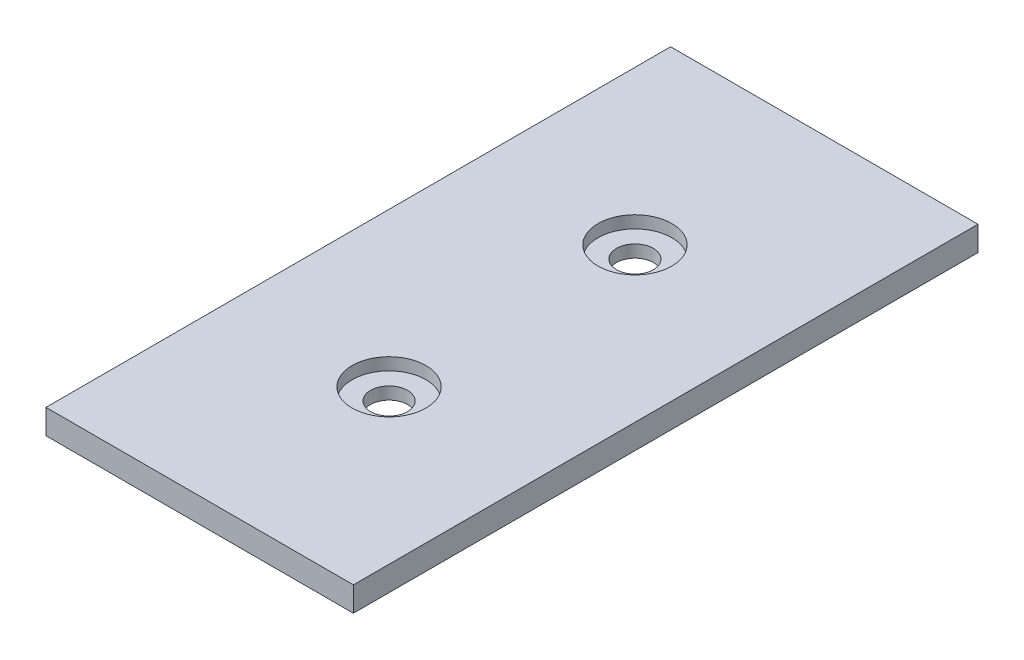
ISO-10303-21;
HEADER;
FILE_DESCRIPTION(('STEP AP214'),'2;1');
FILE_NAME('part.step','',(''),(''),'','','');
FILE_SCHEMA(('AUTOMOTIVE_DESIGN { 1 0 10303 214 1 1 1 1 }'));
ENDSEC;
DATA;
#1=APPLICATION_CONTEXT('core data for automotive mechanical design processes');
#2=APPLICATION_PROTOCOL_DEFINITION('international standard','automotive_design',2000,#1);
#3=PRODUCT_CONTEXT('',#1,'mechanical');
#4=PRODUCT('Part','Part','',(#3));
#5=PRODUCT_RELATED_PRODUCT_CATEGORY('part','',(#4));
#6=PRODUCT_DEFINITION_FORMATION('','',#4);
#7=PRODUCT_DEFINITION_CONTEXT('part definition',#1,'design');
#8=PRODUCT_DEFINITION('design','',#6,#7);
#9=PRODUCT_DEFINITION_SHAPE('','',#8);
#10=(LENGTH_UNIT() NAMED_UNIT(*) SI_UNIT(.MILLI.,.METRE.));
#11=(NAMED_UNIT(*) PLANE_ANGLE_UNIT() SI_UNIT($,.RADIAN.));
#12=(NAMED_UNIT(*) SI_UNIT($,.STERADIAN.) SOLID_ANGLE_UNIT());
#13=UNCERTAINTY_MEASURE_WITH_UNIT(LENGTH_MEASURE(1.E-05),#10,'distance_accuracy_value','');
#14=(GEOMETRIC_REPRESENTATION_CONTEXT(3) GLOBAL_UNCERTAINTY_ASSIGNED_CONTEXT((#13)) GLOBAL_UNIT_ASSIGNED_CONTEXT((#10,
#11,#12)) REPRESENTATION_CONTEXT('',''));
#15=CARTESIAN_POINT('',(0.,0.,0.));
#16=DIRECTION('',(0.,0.,1.));
#17=DIRECTION('',(1.,0.,0.));
#18=AXIS2_PLACEMENT_3D('',#15,#16,#17);
#19=CARTESIAN_POINT('',(0.,-6.,20.));
#20=DIRECTION('',(0.,1.,0.));
#21=DIRECTION('',(0.,0.,1.));
#22=AXIS2_PLACEMENT_3D('',#19,#20,#21);
#23=CYLINDRICAL_SURFACE('',#22,3.);
#24=CARTESIAN_POINT('',(0.,0.,20.));
#25=DIRECTION('',(0.,-1.,0.));
#26=DIRECTION('',(0.,0.,-1.));
#27=AXIS2_PLACEMENT_3D('',#24,#25,#26);
#28=CIRCLE('',#27,3.);
#29=CARTESIAN_POINT('',(0.,0.,17.));
#30=VERTEX_POINT('',#29);
#31=EDGE_CURVE('E130',#30,#30,#28,.T.);
#32=ORIENTED_EDGE('',*,*,#31,.T.);
#33=EDGE_LOOP('',(#32));
#34=FACE_BOUND('',#33,.T.);
#35=CARTESIAN_POINT('',(0.,2.,20.));
#36=DIRECTION('',(0.,1.,0.));
#37=DIRECTION('',(0.,0.,1.));
#38=AXIS2_PLACEMENT_3D('',#35,#36,#37);
#39=CIRCLE('',#38,3.);
#40=CARTESIAN_POINT('',(0.,2.,23.));
#41=VERTEX_POINT('',#40);
#42=EDGE_CURVE('E47',#41,#41,#39,.F.);
#43=ORIENTED_EDGE('',*,*,#42,.F.);
#44=EDGE_LOOP('',(#43));
#45=FACE_BOUND('',#44,.T.);
#46=ADVANCED_FACE('F43',(#34,#45),#23,.F.);
#47=CARTESIAN_POINT('',(0.,-6.,-20.));
#48=DIRECTION('',(0.,1.,0.));
#49=DIRECTION('',(0.,0.,1.));
#50=AXIS2_PLACEMENT_3D('',#47,#48,#49);
#51=CYLINDRICAL_SURFACE('',#50,3.);
#52=CARTESIAN_POINT('',(0.,0.,-20.));
#53=DIRECTION('',(0.,-1.,0.));
#54=DIRECTION('',(0.,0.,-1.));
#55=AXIS2_PLACEMENT_3D('',#52,#53,#54);
#56=CIRCLE('',#55,3.);
#57=CARTESIAN_POINT('',(0.,0.,-23.));
#58=VERTEX_POINT('',#57);
#59=EDGE_CURVE('E119',#58,#58,#56,.T.);
#60=ORIENTED_EDGE('',*,*,#59,.T.);
#61=EDGE_LOOP('',(#60));
#62=FACE_BOUND('',#61,.T.);
#63=CARTESIAN_POINT('',(0.,2.,-20.));
#64=DIRECTION('',(0.,1.,0.));
#65=DIRECTION('',(0.,0.,1.));
#66=AXIS2_PLACEMENT_3D('',#63,#64,#65);
#67=CIRCLE('',#66,3.);
#68=CARTESIAN_POINT('',(0.,2.,-17.));
#69=VERTEX_POINT('',#68);
#70=EDGE_CURVE('E136',#69,#69,#67,.F.);
#71=ORIENTED_EDGE('',*,*,#70,.F.);
#72=EDGE_LOOP('',(#71));
#73=FACE_BOUND('',#72,.T.);
#74=ADVANCED_FACE('F189',(#62,#73),#51,.F.);
#75=CARTESIAN_POINT('',(25.,4.,50.8));
#76=DIRECTION('',(-1.,0.,0.));
#77=DIRECTION('',(0.,0.,1.));
#78=AXIS2_PLACEMENT_3D('',#75,#76,#77);
#79=PLANE('',#78);
#80=DIRECTION('',(0.,0.,-1.));
#81=VECTOR('',#80,1.);
#82=CARTESIAN_POINT('',(25.,0.,50.8));
#83=LINE('',#82,#81);
#84=CARTESIAN_POINT('',(25.,0.,50.8));
#85=VERTEX_POINT('',#84);
#86=CARTESIAN_POINT('',(25.,0.,-50.8));
#87=VERTEX_POINT('',#86);
#88=EDGE_CURVE('E115',#85,#87,#83,.T.);
#89=ORIENTED_EDGE('',*,*,#88,.T.);
#90=DIRECTION('',(0.,-1.,0.));
#91=VECTOR('',#90,1.);
#92=CARTESIAN_POINT('',(25.,4.,-50.8));
#93=LINE('',#92,#91);
#94=CARTESIAN_POINT('',(25.,4.,-50.8));
#95=VERTEX_POINT('',#94);
#96=EDGE_CURVE('E11',#95,#87,#93,.T.);
#97=ORIENTED_EDGE('',*,*,#96,.F.);
#98=DIRECTION('',(0.,0.,-1.));
#99=VECTOR('',#98,1.);
#100=CARTESIAN_POINT('',(25.,4.,50.8));
#101=LINE('',#100,#99);
#102=CARTESIAN_POINT('',(25.,4.,50.8));
#103=VERTEX_POINT('',#102);
#104=EDGE_CURVE('E98',#103,#95,#101,.T.);
#105=ORIENTED_EDGE('',*,*,#104,.F.);
#106=DIRECTION('',(0.,-1.,0.));
#107=VECTOR('',#106,1.);
#108=CARTESIAN_POINT('',(25.,4.,50.8));
#109=LINE('',#108,#107);
#110=EDGE_CURVE('E111',#103,#85,#109,.T.);
#111=ORIENTED_EDGE('',*,*,#110,.T.);
#112=EDGE_LOOP('',(#89,#97,#105,#111));
#113=FACE_BOUND('',#112,.T.);
#114=ADVANCED_FACE('F45',(#113),#79,.F.);
#115=CARTESIAN_POINT('',(-25.,4.,-50.8));
#116=DIRECTION('',(0.,0.,1.));
#117=DIRECTION('',(1.,0.,0.));
#118=AXIS2_PLACEMENT_3D('',#115,#116,#117);
#119=PLANE('',#118);
#120=DIRECTION('',(-1.,0.,0.));
#121=VECTOR('',#120,1.);
#122=CARTESIAN_POINT('',(-25.,0.,-50.8));
#123=LINE('',#122,#121);
#124=CARTESIAN_POINT('',(-25.,0.,-50.8));
#125=VERTEX_POINT('',#124);
#126=EDGE_CURVE('E103',#87,#125,#123,.T.);
#127=ORIENTED_EDGE('',*,*,#126,.T.);
#128=DIRECTION('',(0.,-1.,0.));
#129=VECTOR('',#128,1.);
#130=CARTESIAN_POINT('',(-25.,4.,-50.8));
#131=LINE('',#130,#129);
#132=CARTESIAN_POINT('',(-25.,4.,-50.8));
#133=VERTEX_POINT('',#132);
#134=EDGE_CURVE('E54',#133,#125,#131,.T.);
#135=ORIENTED_EDGE('',*,*,#134,.F.);
#136=DIRECTION('',(-1.,0.,0.));
#137=VECTOR('',#136,1.);
#138=CARTESIAN_POINT('',(-25.,4.,-50.8));
#139=LINE('',#138,#137);
#140=EDGE_CURVE('E93',#95,#133,#139,.T.);
#141=ORIENTED_EDGE('',*,*,#140,.F.);
#142=ORIENTED_EDGE('',*,*,#96,.T.);
#143=EDGE_LOOP('',(#127,#135,#141,#142));
#144=FACE_BOUND('',#143,.T.);
#145=ADVANCED_FACE('F102',(#144),#119,.F.);
#146=CARTESIAN_POINT('',(-25.,4.,50.8));
#147=DIRECTION('',(1.,0.,0.));
#148=DIRECTION('',(0.,0.,-1.));
#149=AXIS2_PLACEMENT_3D('',#146,#147,#148);
#150=PLANE('',#149);
#151=DIRECTION('',(0.,0.,1.));
#152=VECTOR('',#151,1.);
#153=CARTESIAN_POINT('',(-25.,0.,50.8));
#154=LINE('',#153,#152);
#155=CARTESIAN_POINT('',(-25.,0.,50.8));
#156=VERTEX_POINT('',#155);
#157=EDGE_CURVE('E80',#125,#156,#154,.T.);
#158=ORIENTED_EDGE('',*,*,#157,.T.);
#159=DIRECTION('',(0.,-1.,0.));
#160=VECTOR('',#159,1.);
#161=CARTESIAN_POINT('',(-25.,4.,50.8));
#162=LINE('',#161,#160);
#163=CARTESIAN_POINT('',(-25.,4.,50.8));
#164=VERTEX_POINT('',#163);
#165=EDGE_CURVE('E105',#164,#156,#162,.T.);
#166=ORIENTED_EDGE('',*,*,#165,.F.);
#167=DIRECTION('',(0.,0.,1.));
#168=VECTOR('',#167,1.);
#169=CARTESIAN_POINT('',(-25.,4.,50.8));
#170=LINE('',#169,#168);
#171=EDGE_CURVE('E96',#133,#164,#170,.T.);
#172=ORIENTED_EDGE('',*,*,#171,.F.);
#173=ORIENTED_EDGE('',*,*,#134,.T.);
#174=EDGE_LOOP('',(#158,#166,#172,#173));
#175=FACE_BOUND('',#174,.T.);
#176=ADVANCED_FACE('F107',(#175),#150,.F.);
#177=CARTESIAN_POINT('',(-25.,4.,50.8));
#178=DIRECTION('',(0.,0.,-1.));
#179=DIRECTION('',(-1.,0.,0.));
#180=AXIS2_PLACEMENT_3D('',#177,#178,#179);
#181=PLANE('',#180);
#182=DIRECTION('',(1.,0.,0.));
#183=VECTOR('',#182,1.);
#184=CARTESIAN_POINT('',(-25.,0.,50.8));
#185=LINE('',#184,#183);
#186=EDGE_CURVE('E86',#156,#85,#185,.T.);
#187=ORIENTED_EDGE('',*,*,#186,.T.);
#188=ORIENTED_EDGE('',*,*,#110,.F.);
#189=DIRECTION('',(1.,0.,0.));
#190=VECTOR('',#189,1.);
#191=CARTESIAN_POINT('',(-25.,4.,50.8));
#192=LINE('',#191,#190);
#193=EDGE_CURVE('E63',#164,#103,#192,.T.);
#194=ORIENTED_EDGE('',*,*,#193,.F.);
#195=ORIENTED_EDGE('',*,*,#165,.T.);
#196=EDGE_LOOP('',(#187,#188,#194,#195));
#197=FACE_BOUND('',#196,.T.);
#198=ADVANCED_FACE('F175',(#197),#181,.F.);
#199=CARTESIAN_POINT('',(0.,4.,0.));
#200=DIRECTION('',(0.,-1.,0.));
#201=DIRECTION('',(0.,0.,-1.));
#202=AXIS2_PLACEMENT_3D('',#199,#200,#201);
#203=PLANE('',#202);
#204=CARTESIAN_POINT('',(0.,4.,-20.));
#205=DIRECTION('',(0.,1.,0.));
#206=DIRECTION('',(0.,0.,1.));
#207=AXIS2_PLACEMENT_3D('',#204,#205,#206);
#208=CIRCLE('',#207,6.);
#209=CARTESIAN_POINT('',(0.,4.,-14.));
#210=VERTEX_POINT('',#209);
#211=EDGE_CURVE('E146',#210,#210,#208,.T.);
#212=ORIENTED_EDGE('',*,*,#211,.F.);
#213=EDGE_LOOP('',(#212));
#214=FACE_BOUND('',#213,.T.);
#215=CARTESIAN_POINT('',(0.,4.,20.));
#216=DIRECTION('',(0.,1.,0.));
#217=DIRECTION('',(0.,0.,1.));
#218=AXIS2_PLACEMENT_3D('',#215,#216,#217);
#219=CIRCLE('',#218,6.);
#220=CARTESIAN_POINT('',(0.,4.,26.));
#221=VERTEX_POINT('',#220);
#222=EDGE_CURVE('E152',#221,#221,#219,.T.);
#223=ORIENTED_EDGE('',*,*,#222,.F.);
#224=EDGE_LOOP('',(#223));
#225=FACE_BOUND('',#224,.T.);
#226=ORIENTED_EDGE('',*,*,#104,.T.);
#227=ORIENTED_EDGE('',*,*,#140,.T.);
#228=ORIENTED_EDGE('',*,*,#171,.T.);
#229=ORIENTED_EDGE('',*,*,#193,.T.);
#230=EDGE_LOOP('',(#226,#227,#228,#229));
#231=FACE_BOUND('',#230,.T.);
#232=ADVANCED_FACE('F94',(#214,#225,#231),#203,.F.);
#233=CARTESIAN_POINT('',(0.,0.,0.));
#234=DIRECTION('',(0.,-1.,0.));
#235=DIRECTION('',(0.,0.,-1.));
#236=AXIS2_PLACEMENT_3D('',#233,#234,#235);
#237=PLANE('',#236);
#238=ORIENTED_EDGE('',*,*,#59,.F.);
#239=EDGE_LOOP('',(#238));
#240=FACE_BOUND('',#239,.T.);
#241=ORIENTED_EDGE('',*,*,#31,.F.);
#242=EDGE_LOOP('',(#241));
#243=FACE_BOUND('',#242,.T.);
#244=ORIENTED_EDGE('',*,*,#88,.F.);
#245=ORIENTED_EDGE('',*,*,#186,.F.);
#246=ORIENTED_EDGE('',*,*,#157,.F.);
#247=ORIENTED_EDGE('',*,*,#126,.F.);
#248=EDGE_LOOP('',(#244,#245,#246,#247));
#249=FACE_BOUND('',#248,.T.);
#250=ADVANCED_FACE('F174',(#240,#243,#249),#237,.T.);
#251=CARTESIAN_POINT('',(0.,2.,-20.));
#252=DIRECTION('',(0.,1.,0.));
#253=DIRECTION('',(0.,0.,1.));
#254=AXIS2_PLACEMENT_3D('',#251,#252,#253);
#255=PLANE('',#254);
#256=CARTESIAN_POINT('',(0.,2.,-20.));
#257=DIRECTION('',(0.,1.,0.));
#258=DIRECTION('',(0.,0.,1.));
#259=AXIS2_PLACEMENT_3D('',#256,#257,#258);
#260=CIRCLE('',#259,6.);
#261=CARTESIAN_POINT('',(0.,2.,-14.));
#262=VERTEX_POINT('',#261);
#263=EDGE_CURVE('E139',#262,#262,#260,.T.);
#264=ORIENTED_EDGE('',*,*,#263,.T.);
#265=EDGE_LOOP('',(#264));
#266=FACE_BOUND('',#265,.T.);
#267=ORIENTED_EDGE('',*,*,#70,.T.);
#268=EDGE_LOOP('',(#267));
#269=FACE_BOUND('',#268,.T.);
#270=ADVANCED_FACE('F182',(#266,#269),#255,.T.);
#271=CARTESIAN_POINT('',(0.,2.,-20.));
#272=DIRECTION('',(0.,1.,0.));
#273=DIRECTION('',(0.,0.,1.));
#274=AXIS2_PLACEMENT_3D('',#271,#272,#273);
#275=CYLINDRICAL_SURFACE('',#274,6.);
#276=ORIENTED_EDGE('',*,*,#263,.F.);
#277=EDGE_LOOP('',(#276));
#278=FACE_BOUND('',#277,.T.);
#279=ORIENTED_EDGE('',*,*,#211,.T.);
#280=EDGE_LOOP('',(#279));
#281=FACE_BOUND('',#280,.T.);
#282=ADVANCED_FACE('F199',(#278,#281),#275,.F.);
#283=CARTESIAN_POINT('',(0.,2.,20.));
#284=DIRECTION('',(0.,1.,0.));
#285=DIRECTION('',(0.,0.,1.));
#286=AXIS2_PLACEMENT_3D('',#283,#284,#285);
#287=PLANE('',#286);
#288=CARTESIAN_POINT('',(0.,2.,20.));
#289=DIRECTION('',(0.,1.,0.));
#290=DIRECTION('',(0.,0.,1.));
#291=AXIS2_PLACEMENT_3D('',#288,#289,#290);
#292=CIRCLE('',#291,6.);
#293=CARTESIAN_POINT('',(0.,2.,26.));
#294=VERTEX_POINT('',#293);
#295=EDGE_CURVE('E158',#294,#294,#292,.T.);
#296=ORIENTED_EDGE('',*,*,#295,.T.);
#297=EDGE_LOOP('',(#296));
#298=FACE_BOUND('',#297,.T.);
#299=ORIENTED_EDGE('',*,*,#42,.T.);
#300=EDGE_LOOP('',(#299));
#301=FACE_BOUND('',#300,.T.);
#302=ADVANCED_FACE('F164',(#298,#301),#287,.T.);
#303=CARTESIAN_POINT('',(0.,2.,20.));
#304=DIRECTION('',(0.,1.,0.));
#305=DIRECTION('',(0.,0.,1.));
#306=AXIS2_PLACEMENT_3D('',#303,#304,#305);
#307=CYLINDRICAL_SURFACE('',#306,6.);
#308=ORIENTED_EDGE('',*,*,#295,.F.);
#309=EDGE_LOOP('',(#308));
#310=FACE_BOUND('',#309,.T.);
#311=ORIENTED_EDGE('',*,*,#222,.T.);
#312=EDGE_LOOP('',(#311));
#313=FACE_BOUND('',#312,.T.);
#314=ADVANCED_FACE('F167',(#310,#313),#307,.F.);
#315=CLOSED_SHELL('',(#46,#74,#114,#145,#176,#198,#232,#250,#270,#282,#302,#314));
#316=MANIFOLD_SOLID_BREP('B2',#315);
#317=ADVANCED_BREP_SHAPE_REPRESENTATION('',(#18,#316),#14);
#318=SHAPE_DEFINITION_REPRESENTATION(#9,#317);
ENDSEC;
END-ISO-10303-21;
